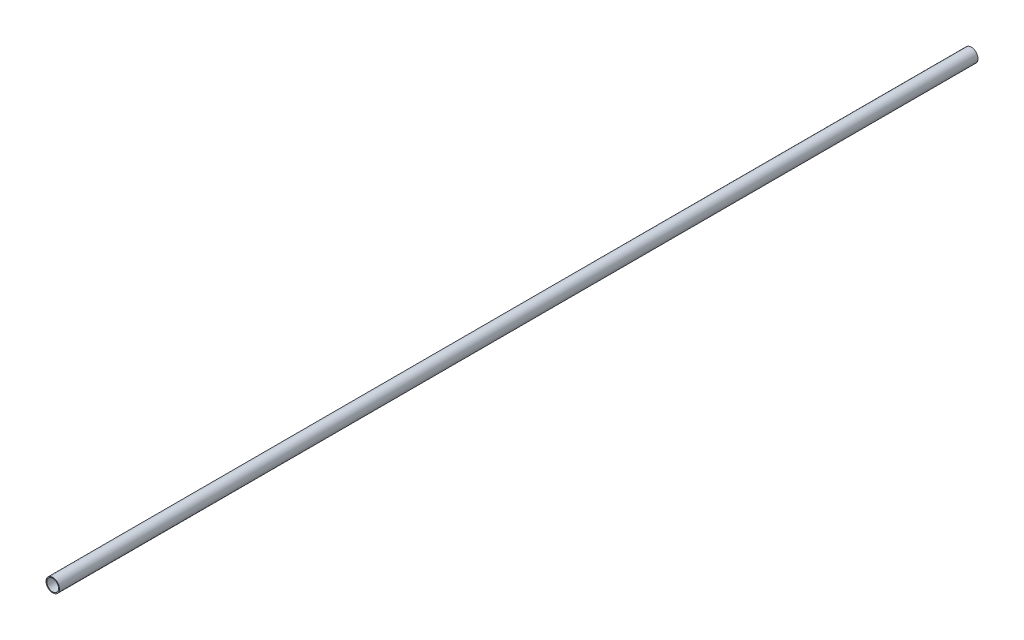
ISO-10303-21;
HEADER;
FILE_DESCRIPTION(('STEP AP214'),'2;1');
FILE_NAME('part.step','',(''),(''),'','','');
FILE_SCHEMA(('AUTOMOTIVE_DESIGN { 1 0 10303 214 1 1 1 1 }'));
ENDSEC;
DATA;
#1=APPLICATION_CONTEXT('core data for automotive mechanical design processes');
#2=APPLICATION_PROTOCOL_DEFINITION('international standard','automotive_design',2000,#1);
#3=PRODUCT_CONTEXT('',#1,'mechanical');
#4=PRODUCT('Part','Part','',(#3));
#5=PRODUCT_RELATED_PRODUCT_CATEGORY('part','',(#4));
#6=PRODUCT_DEFINITION_FORMATION('','',#4);
#7=PRODUCT_DEFINITION_CONTEXT('part definition',#1,'design');
#8=PRODUCT_DEFINITION('design','',#6,#7);
#9=PRODUCT_DEFINITION_SHAPE('','',#8);
#10=(LENGTH_UNIT() NAMED_UNIT(*) SI_UNIT(.MILLI.,.METRE.));
#11=(NAMED_UNIT(*) PLANE_ANGLE_UNIT() SI_UNIT($,.RADIAN.));
#12=(NAMED_UNIT(*) SI_UNIT($,.STERADIAN.) SOLID_ANGLE_UNIT());
#13=UNCERTAINTY_MEASURE_WITH_UNIT(LENGTH_MEASURE(1.E-05),#10,'distance_accuracy_value','');
#14=(GEOMETRIC_REPRESENTATION_CONTEXT(3) GLOBAL_UNCERTAINTY_ASSIGNED_CONTEXT((#13)) GLOBAL_UNIT_ASSIGNED_CONTEXT((#10,
#11,#12)) REPRESENTATION_CONTEXT('',''));
#15=CARTESIAN_POINT('',(0.,0.,0.));
#16=DIRECTION('',(0.,0.,1.));
#17=DIRECTION('',(1.,0.,0.));
#18=AXIS2_PLACEMENT_3D('',#15,#16,#17);
#19=CARTESIAN_POINT('',(0.,0.,742.95));
#20=DIRECTION('',(0.,0.,1.));
#21=DIRECTION('',(1.,0.,0.));
#22=AXIS2_PLACEMENT_3D('',#19,#20,#21);
#23=PLANE('',#22);
#24=CARTESIAN_POINT('',(0.,0.,742.95));
#25=DIRECTION('',(0.,0.,1.));
#26=DIRECTION('',(1.,0.,0.));
#27=AXIS2_PLACEMENT_3D('',#24,#25,#26);
#28=CIRCLE('',#27,10.922);
#29=CARTESIAN_POINT('',(10.922,0.,742.95));
#30=VERTEX_POINT('',#29);
#31=EDGE_CURVE('E10',#30,#30,#28,.T.);
#32=ORIENTED_EDGE('',*,*,#31,.T.);
#33=EDGE_LOOP('',(#32));
#34=FACE_BOUND('',#33,.T.);
#35=CARTESIAN_POINT('',(0.,0.,742.95));
#36=DIRECTION('',(0.,0.,1.));
#37=DIRECTION('',(1.,0.,0.));
#38=AXIS2_PLACEMENT_3D('',#35,#36,#37);
#39=CIRCLE('',#38,9.525);
#40=CARTESIAN_POINT('',(9.525,0.,742.95));
#41=VERTEX_POINT('',#40);
#42=EDGE_CURVE('E46',#41,#41,#39,.T.);
#43=ORIENTED_EDGE('',*,*,#42,.F.);
#44=EDGE_LOOP('',(#43));
#45=FACE_BOUND('',#44,.T.);
#46=ADVANCED_FACE('F39',(#34,#45),#23,.T.);
#47=CARTESIAN_POINT('',(0.,0.,742.95));
#48=DIRECTION('',(0.,0.,-1.));
#49=DIRECTION('',(-1.,0.,0.));
#50=AXIS2_PLACEMENT_3D('',#47,#48,#49);
#51=CYLINDRICAL_SURFACE('',#50,10.922);
#52=ORIENTED_EDGE('',*,*,#31,.F.);
#53=EDGE_LOOP('',(#52));
#54=FACE_BOUND('',#53,.T.);
#55=CARTESIAN_POINT('',(0.,0.,-742.95));
#56=DIRECTION('',(0.,0.,1.));
#57=DIRECTION('',(1.,0.,0.));
#58=AXIS2_PLACEMENT_3D('',#55,#56,#57);
#59=CIRCLE('',#58,10.922);
#60=CARTESIAN_POINT('',(10.922,0.,-742.95));
#61=VERTEX_POINT('',#60);
#62=EDGE_CURVE('E50',#61,#61,#59,.T.);
#63=ORIENTED_EDGE('',*,*,#62,.T.);
#64=EDGE_LOOP('',(#63));
#65=FACE_BOUND('',#64,.T.);
#66=ADVANCED_FACE('F41',(#54,#65),#51,.T.);
#67=CARTESIAN_POINT('',(0.,0.,742.95));
#68=DIRECTION('',(0.,0.,-1.));
#69=DIRECTION('',(-1.,0.,0.));
#70=AXIS2_PLACEMENT_3D('',#67,#68,#69);
#71=CYLINDRICAL_SURFACE('',#70,9.525);
#72=ORIENTED_EDGE('',*,*,#42,.T.);
#73=EDGE_LOOP('',(#72));
#74=FACE_BOUND('',#73,.T.);
#75=CARTESIAN_POINT('',(0.,0.,-742.95));
#76=DIRECTION('',(0.,0.,1.));
#77=DIRECTION('',(1.,0.,0.));
#78=AXIS2_PLACEMENT_3D('',#75,#76,#77);
#79=CIRCLE('',#78,9.525);
#80=CARTESIAN_POINT('',(9.525,0.,-742.95));
#81=VERTEX_POINT('',#80);
#82=EDGE_CURVE('E54',#81,#81,#79,.T.);
#83=ORIENTED_EDGE('',*,*,#82,.F.);
#84=EDGE_LOOP('',(#83));
#85=FACE_BOUND('',#84,.T.);
#86=ADVANCED_FACE('F63',(#74,#85),#71,.F.);
#87=CARTESIAN_POINT('',(0.,0.,-742.95));
#88=DIRECTION('',(0.,0.,1.));
#89=DIRECTION('',(1.,0.,0.));
#90=AXIS2_PLACEMENT_3D('',#87,#88,#89);
#91=PLANE('',#90);
#92=ORIENTED_EDGE('',*,*,#82,.T.);
#93=EDGE_LOOP('',(#92));
#94=FACE_BOUND('',#93,.T.);
#95=ORIENTED_EDGE('',*,*,#62,.F.);
#96=EDGE_LOOP('',(#95));
#97=FACE_BOUND('',#96,.T.);
#98=ADVANCED_FACE('F60',(#94,#97),#91,.F.);
#99=CLOSED_SHELL('',(#46,#66,#86,#98));
#100=MANIFOLD_SOLID_BREP('B2',#99);
#101=ADVANCED_BREP_SHAPE_REPRESENTATION('',(#18,#100),#14);
#102=SHAPE_DEFINITION_REPRESENTATION(#9,#101);
ENDSEC;
END-ISO-10303-21;
